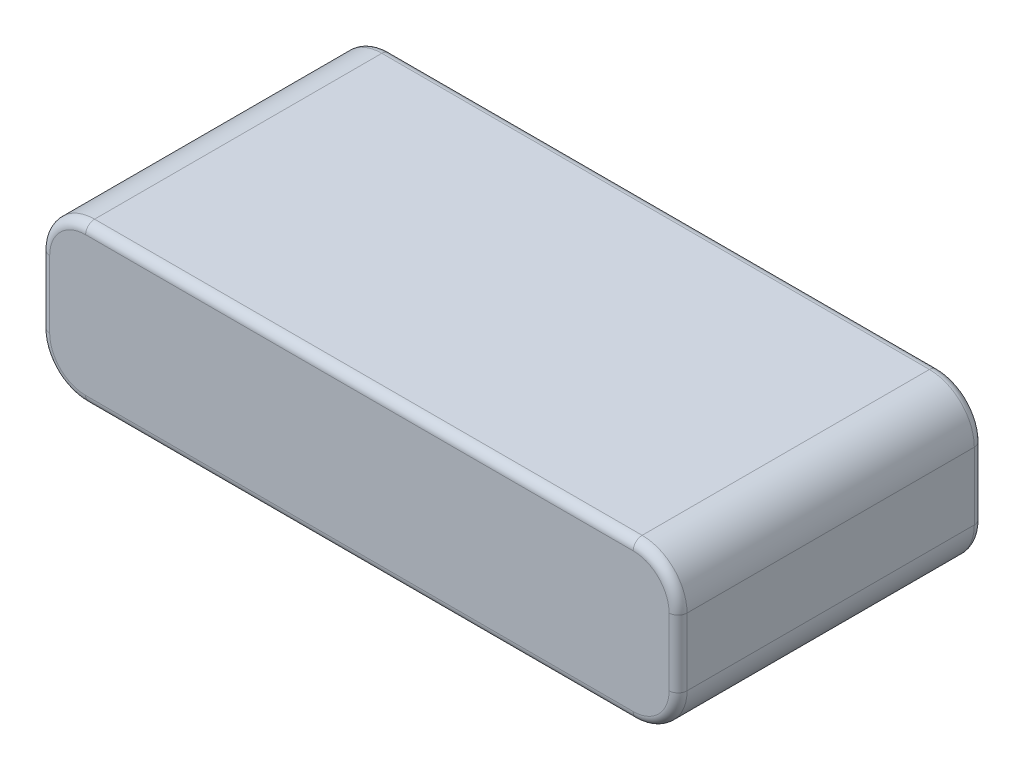
ISO-10303-21;
HEADER;
FILE_DESCRIPTION(('STEP AP214'),'2;1');
FILE_NAME('part.step','',(''),(''),'','','');
FILE_SCHEMA(('AUTOMOTIVE_DESIGN { 1 0 10303 214 1 1 1 1 }'));
ENDSEC;
DATA;
#1=APPLICATION_CONTEXT('core data for automotive mechanical design processes');
#2=APPLICATION_PROTOCOL_DEFINITION('international standard','automotive_design',2000,#1);
#3=PRODUCT_CONTEXT('',#1,'mechanical');
#4=PRODUCT('Part','Part','',(#3));
#5=PRODUCT_RELATED_PRODUCT_CATEGORY('part','',(#4));
#6=PRODUCT_DEFINITION_FORMATION('','',#4);
#7=PRODUCT_DEFINITION_CONTEXT('part definition',#1,'design');
#8=PRODUCT_DEFINITION('design','',#6,#7);
#9=PRODUCT_DEFINITION_SHAPE('','',#8);
#10=(LENGTH_UNIT() NAMED_UNIT(*) SI_UNIT(.MILLI.,.METRE.));
#11=(NAMED_UNIT(*) PLANE_ANGLE_UNIT() SI_UNIT($,.RADIAN.));
#12=(NAMED_UNIT(*) SI_UNIT($,.STERADIAN.) SOLID_ANGLE_UNIT());
#13=UNCERTAINTY_MEASURE_WITH_UNIT(LENGTH_MEASURE(1.E-05),#10,'distance_accuracy_value','');
#14=(GEOMETRIC_REPRESENTATION_CONTEXT(3) GLOBAL_UNCERTAINTY_ASSIGNED_CONTEXT((#13)) GLOBAL_UNIT_ASSIGNED_CONTEXT((#10,
#11,#12)) REPRESENTATION_CONTEXT('',''));
#15=CARTESIAN_POINT('',(0.,0.,0.));
#16=DIRECTION('',(0.,0.,1.));
#17=DIRECTION('',(1.,0.,0.));
#18=AXIS2_PLACEMENT_3D('',#15,#16,#17);
#19=CARTESIAN_POINT('',(-35.5,17.5,17.));
#20=DIRECTION('',(1.,0.,0.));
#21=DIRECTION('',(0.,0.,-1.));
#22=AXIS2_PLACEMENT_3D('',#19,#20,#21);
#23=PLANE('',#22);
#24=DIRECTION('',(0.,0.,1.));
#25=VECTOR('',#24,1.);
#26=CARTESIAN_POINT('',(-35.5,5.,17.));
#27=LINE('',#26,#25);
#28=CARTESIAN_POINT('',(-35.5,5.,-16.));
#29=VERTEX_POINT('',#28);
#30=CARTESIAN_POINT('',(-35.5,5.,16.));
#31=VERTEX_POINT('',#30);
#32=EDGE_CURVE('E287',#29,#31,#27,.T.);
#33=ORIENTED_EDGE('',*,*,#32,.T.);
#34=DIRECTION('',(0.,-1.,0.));
#35=VECTOR('',#34,1.);
#36=CARTESIAN_POINT('',(-35.5,17.5,16.));
#37=LINE('',#36,#35);
#38=CARTESIAN_POINT('',(-35.5,12.5,16.));
#39=VERTEX_POINT('',#38);
#40=EDGE_CURVE('E203',#31,#39,#37,.F.);
#41=ORIENTED_EDGE('',*,*,#40,.T.);
#42=DIRECTION('',(0.,0.,1.));
#43=VECTOR('',#42,1.);
#44=CARTESIAN_POINT('',(-35.5,12.5,-17.));
#45=LINE('',#44,#43);
#46=CARTESIAN_POINT('',(-35.5,12.5,-16.));
#47=VERTEX_POINT('',#46);
#48=EDGE_CURVE('E292',#39,#47,#45,.F.);
#49=ORIENTED_EDGE('',*,*,#48,.T.);
#50=DIRECTION('',(0.,-1.,0.));
#51=VECTOR('',#50,1.);
#52=CARTESIAN_POINT('',(-35.5,17.5,-16.));
#53=LINE('',#52,#51);
#54=EDGE_CURVE('E201',#47,#29,#53,.T.);
#55=ORIENTED_EDGE('',*,*,#54,.T.);
#56=EDGE_LOOP('',(#33,#41,#49,#55));
#57=FACE_BOUND('',#56,.T.);
#58=ADVANCED_FACE('F37',(#57),#23,.F.);
#59=CARTESIAN_POINT('',(35.5,17.5,17.));
#60=DIRECTION('',(0.,0.,-1.));
#61=DIRECTION('',(-1.,0.,0.));
#62=AXIS2_PLACEMENT_3D('',#59,#60,#61);
#63=PLANE('',#62);
#64=DIRECTION('',(0.,-1.,0.));
#65=VECTOR('',#64,1.);
#66=CARTESIAN_POINT('',(34.5,17.5,17.));
#67=LINE('',#66,#65);
#68=CARTESIAN_POINT('',(34.5,5.,17.));
#69=VERTEX_POINT('',#68);
#70=CARTESIAN_POINT('',(34.5,12.5,17.));
#71=VERTEX_POINT('',#70);
#72=EDGE_CURVE('E174',#69,#71,#67,.F.);
#73=ORIENTED_EDGE('',*,*,#72,.T.);
#74=CARTESIAN_POINT('',(30.5,12.5,17.));
#75=DIRECTION('',(0.,0.,-1.));
#76=DIRECTION('',(-1.,0.,0.));
#77=AXIS2_PLACEMENT_3D('',#74,#75,#76);
#78=CIRCLE('',#77,4.);
#79=CARTESIAN_POINT('',(30.5,16.5,17.));
#80=VERTEX_POINT('',#79);
#81=EDGE_CURVE('E155',#71,#80,#78,.F.);
#82=ORIENTED_EDGE('',*,*,#81,.T.);
#83=DIRECTION('',(1.,0.,0.));
#84=VECTOR('',#83,1.);
#85=CARTESIAN_POINT('',(-30.5,16.5,17.));
#86=LINE('',#85,#84);
#87=CARTESIAN_POINT('',(-30.5,16.5,17.));
#88=VERTEX_POINT('',#87);
#89=EDGE_CURVE('E163',#80,#88,#86,.F.);
#90=ORIENTED_EDGE('',*,*,#89,.T.);
#91=CARTESIAN_POINT('',(-30.5,12.5,17.));
#92=DIRECTION('',(0.,0.,-1.));
#93=DIRECTION('',(-1.,0.,0.));
#94=AXIS2_PLACEMENT_3D('',#91,#92,#93);
#95=CIRCLE('',#94,4.);
#96=CARTESIAN_POINT('',(-34.5,12.5,17.));
#97=VERTEX_POINT('',#96);
#98=EDGE_CURVE('E169',#88,#97,#95,.F.);
#99=ORIENTED_EDGE('',*,*,#98,.T.);
#100=DIRECTION('',(0.,-1.,0.));
#101=VECTOR('',#100,1.);
#102=CARTESIAN_POINT('',(-34.5,17.5,17.));
#103=LINE('',#102,#101);
#104=CARTESIAN_POINT('',(-34.5,5.,17.));
#105=VERTEX_POINT('',#104);
#106=EDGE_CURVE('E305',#97,#105,#103,.T.);
#107=ORIENTED_EDGE('',*,*,#106,.T.);
#108=CARTESIAN_POINT('',(-30.5,5.,17.));
#109=DIRECTION('',(0.,0.,-1.));
#110=DIRECTION('',(-1.,0.,0.));
#111=AXIS2_PLACEMENT_3D('',#108,#109,#110);
#112=CIRCLE('',#111,4.);
#113=CARTESIAN_POINT('',(-30.5,1.,17.));
#114=VERTEX_POINT('',#113);
#115=EDGE_CURVE('E307',#105,#114,#112,.F.);
#116=ORIENTED_EDGE('',*,*,#115,.T.);
#117=DIRECTION('',(1.,0.,0.));
#118=VECTOR('',#117,1.);
#119=CARTESIAN_POINT('',(35.5,1.,17.));
#120=LINE('',#119,#118);
#121=CARTESIAN_POINT('',(30.5,1.,17.));
#122=VERTEX_POINT('',#121);
#123=EDGE_CURVE('E309',#114,#122,#120,.T.);
#124=ORIENTED_EDGE('',*,*,#123,.T.);
#125=CARTESIAN_POINT('',(30.5,5.,17.));
#126=DIRECTION('',(0.,0.,-1.));
#127=DIRECTION('',(-1.,0.,0.));
#128=AXIS2_PLACEMENT_3D('',#125,#126,#127);
#129=CIRCLE('',#128,4.);
#130=EDGE_CURVE('E179',#122,#69,#129,.F.);
#131=ORIENTED_EDGE('',*,*,#130,.T.);
#132=EDGE_LOOP('',(#73,#82,#90,#99,#107,#116,#124,#131));
#133=FACE_BOUND('',#132,.T.);
#134=ADVANCED_FACE('F172',(#133),#63,.F.);
#135=CARTESIAN_POINT('',(35.5,17.5,17.));
#136=DIRECTION('',(-1.,0.,0.));
#137=DIRECTION('',(0.,0.,1.));
#138=AXIS2_PLACEMENT_3D('',#135,#136,#137);
#139=PLANE('',#138);
#140=DIRECTION('',(0.,0.,-1.));
#141=VECTOR('',#140,1.);
#142=CARTESIAN_POINT('',(35.5,12.5,17.));
#143=LINE('',#142,#141);
#144=CARTESIAN_POINT('',(35.5,12.5,-16.));
#145=VERTEX_POINT('',#144);
#146=CARTESIAN_POINT('',(35.5,12.5,16.));
#147=VERTEX_POINT('',#146);
#148=EDGE_CURVE('E280',#145,#147,#143,.F.);
#149=ORIENTED_EDGE('',*,*,#148,.T.);
#150=DIRECTION('',(0.,-1.,0.));
#151=VECTOR('',#150,1.);
#152=CARTESIAN_POINT('',(35.5,17.5,16.));
#153=LINE('',#152,#151);
#154=CARTESIAN_POINT('',(35.5,5.,16.));
#155=VERTEX_POINT('',#154);
#156=EDGE_CURVE('E186',#147,#155,#153,.T.);
#157=ORIENTED_EDGE('',*,*,#156,.T.);
#158=DIRECTION('',(0.,0.,-1.));
#159=VECTOR('',#158,1.);
#160=CARTESIAN_POINT('',(35.5,5.,17.));
#161=LINE('',#160,#159);
#162=CARTESIAN_POINT('',(35.5,5.,-16.));
#163=VERTEX_POINT('',#162);
#164=EDGE_CURVE('E170',#155,#163,#161,.T.);
#165=ORIENTED_EDGE('',*,*,#164,.T.);
#166=DIRECTION('',(0.,-1.,0.));
#167=VECTOR('',#166,1.);
#168=CARTESIAN_POINT('',(35.5,17.5,-16.));
#169=LINE('',#168,#167);
#170=EDGE_CURVE('E184',#163,#145,#169,.F.);
#171=ORIENTED_EDGE('',*,*,#170,.T.);
#172=EDGE_LOOP('',(#149,#157,#165,#171));
#173=FACE_BOUND('',#172,.T.);
#174=ADVANCED_FACE('F322',(#173),#139,.F.);
#175=CARTESIAN_POINT('',(35.5,17.5,-17.));
#176=DIRECTION('',(0.,0.,1.));
#177=DIRECTION('',(1.,0.,0.));
#178=AXIS2_PLACEMENT_3D('',#175,#176,#177);
#179=PLANE('',#178);
#180=DIRECTION('',(-1.,0.,0.));
#181=VECTOR('',#180,1.);
#182=CARTESIAN_POINT('',(35.5,1.,-17.));
#183=LINE('',#182,#181);
#184=CARTESIAN_POINT('',(30.5,1.,-17.));
#185=VERTEX_POINT('',#184);
#186=CARTESIAN_POINT('',(-30.5,1.,-17.));
#187=VERTEX_POINT('',#186);
#188=EDGE_CURVE('E46',#185,#187,#183,.T.);
#189=ORIENTED_EDGE('',*,*,#188,.T.);
#190=CARTESIAN_POINT('',(-30.5,5.,-17.));
#191=DIRECTION('',(0.,0.,1.));
#192=DIRECTION('',(1.,0.,0.));
#193=AXIS2_PLACEMENT_3D('',#190,#191,#192);
#194=CIRCLE('',#193,4.);
#195=CARTESIAN_POINT('',(-34.5,5.,-17.));
#196=VERTEX_POINT('',#195);
#197=EDGE_CURVE('E11',#187,#196,#194,.F.);
#198=ORIENTED_EDGE('',*,*,#197,.T.);
#199=DIRECTION('',(0.,-1.,0.));
#200=VECTOR('',#199,1.);
#201=CARTESIAN_POINT('',(-34.5,17.5,-17.));
#202=LINE('',#201,#200);
#203=CARTESIAN_POINT('',(-34.5,12.5,-17.));
#204=VERTEX_POINT('',#203);
#205=EDGE_CURVE('E213',#196,#204,#202,.F.);
#206=ORIENTED_EDGE('',*,*,#205,.T.);
#207=CARTESIAN_POINT('',(-30.5,12.5,-17.));
#208=DIRECTION('',(0.,0.,1.));
#209=DIRECTION('',(1.,0.,0.));
#210=AXIS2_PLACEMENT_3D('',#207,#208,#209);
#211=CIRCLE('',#210,4.);
#212=CARTESIAN_POINT('',(-30.5,16.5,-17.));
#213=VERTEX_POINT('',#212);
#214=EDGE_CURVE('E215',#204,#213,#211,.F.);
#215=ORIENTED_EDGE('',*,*,#214,.T.);
#216=DIRECTION('',(-1.,0.,0.));
#217=VECTOR('',#216,1.);
#218=CARTESIAN_POINT('',(30.5,16.5,-17.));
#219=LINE('',#218,#217);
#220=CARTESIAN_POINT('',(30.5,16.5,-17.));
#221=VERTEX_POINT('',#220);
#222=EDGE_CURVE('E217',#213,#221,#219,.F.);
#223=ORIENTED_EDGE('',*,*,#222,.T.);
#224=CARTESIAN_POINT('',(30.5,12.5,-17.));
#225=DIRECTION('',(0.,0.,1.));
#226=DIRECTION('',(1.,0.,0.));
#227=AXIS2_PLACEMENT_3D('',#224,#225,#226);
#228=CIRCLE('',#227,4.);
#229=CARTESIAN_POINT('',(34.5,12.5,-17.));
#230=VERTEX_POINT('',#229);
#231=EDGE_CURVE('E219',#221,#230,#228,.F.);
#232=ORIENTED_EDGE('',*,*,#231,.T.);
#233=DIRECTION('',(0.,-1.,0.));
#234=VECTOR('',#233,1.);
#235=CARTESIAN_POINT('',(34.5,17.5,-17.));
#236=LINE('',#235,#234);
#237=CARTESIAN_POINT('',(34.5,5.,-17.));
#238=VERTEX_POINT('',#237);
#239=EDGE_CURVE('E221',#230,#238,#236,.T.);
#240=ORIENTED_EDGE('',*,*,#239,.T.);
#241=CARTESIAN_POINT('',(30.5,5.,-17.));
#242=DIRECTION('',(0.,0.,1.));
#243=DIRECTION('',(1.,0.,0.));
#244=AXIS2_PLACEMENT_3D('',#241,#242,#243);
#245=CIRCLE('',#244,4.);
#246=EDGE_CURVE('E57',#238,#185,#245,.F.);
#247=ORIENTED_EDGE('',*,*,#246,.T.);
#248=EDGE_LOOP('',(#189,#198,#206,#215,#223,#232,#240,#247));
#249=FACE_BOUND('',#248,.T.);
#250=ADVANCED_FACE('F338',(#249),#179,.F.);
#251=CARTESIAN_POINT('',(0.,17.5,0.));
#252=DIRECTION('',(0.,1.,0.));
#253=DIRECTION('',(0.,0.,1.));
#254=AXIS2_PLACEMENT_3D('',#251,#252,#253);
#255=PLANE('',#254);
#256=DIRECTION('',(0.,0.,1.));
#257=VECTOR('',#256,1.);
#258=CARTESIAN_POINT('',(-30.5,17.5,17.));
#259=LINE('',#258,#257);
#260=CARTESIAN_POINT('',(-30.5,17.5,-16.));
#261=VERTEX_POINT('',#260);
#262=CARTESIAN_POINT('',(-30.5,17.5,16.));
#263=VERTEX_POINT('',#262);
#264=EDGE_CURVE('E285',#261,#263,#259,.T.);
#265=ORIENTED_EDGE('',*,*,#264,.T.);
#266=DIRECTION('',(1.,0.,0.));
#267=VECTOR('',#266,1.);
#268=CARTESIAN_POINT('',(30.5,17.5,16.));
#269=LINE('',#268,#267);
#270=CARTESIAN_POINT('',(30.5,17.5,16.));
#271=VERTEX_POINT('',#270);
#272=EDGE_CURVE('E211',#263,#271,#269,.T.);
#273=ORIENTED_EDGE('',*,*,#272,.T.);
#274=DIRECTION('',(0.,0.,-1.));
#275=VECTOR('',#274,1.);
#276=CARTESIAN_POINT('',(30.5,17.5,-17.));
#277=LINE('',#276,#275);
#278=CARTESIAN_POINT('',(30.5,17.5,-16.));
#279=VERTEX_POINT('',#278);
#280=EDGE_CURVE('E242',#271,#279,#277,.T.);
#281=ORIENTED_EDGE('',*,*,#280,.T.);
#282=DIRECTION('',(-1.,0.,0.));
#283=VECTOR('',#282,1.);
#284=CARTESIAN_POINT('',(-30.5,17.5,-16.));
#285=LINE('',#284,#283);
#286=EDGE_CURVE('E209',#279,#261,#285,.T.);
#287=ORIENTED_EDGE('',*,*,#286,.T.);
#288=EDGE_LOOP('',(#265,#273,#281,#287));
#289=FACE_BOUND('',#288,.T.);
#290=ADVANCED_FACE('F283',(#289),#255,.T.);
#291=CARTESIAN_POINT('',(0.,0.,0.));
#292=DIRECTION('',(0.,1.,0.));
#293=DIRECTION('',(0.,0.,1.));
#294=AXIS2_PLACEMENT_3D('',#291,#292,#293);
#295=PLANE('',#294);
#296=DIRECTION('',(0.,0.,-1.));
#297=VECTOR('',#296,1.);
#298=CARTESIAN_POINT('',(30.5,0.,0.));
#299=LINE('',#298,#297);
#300=CARTESIAN_POINT('',(30.5,0.,-16.));
#301=VERTEX_POINT('',#300);
#302=CARTESIAN_POINT('',(30.5,0.,16.));
#303=VERTEX_POINT('',#302);
#304=EDGE_CURVE('E295',#301,#303,#299,.F.);
#305=ORIENTED_EDGE('',*,*,#304,.T.);
#306=DIRECTION('',(1.,0.,0.));
#307=VECTOR('',#306,1.);
#308=CARTESIAN_POINT('',(0.,0.,16.));
#309=LINE('',#308,#307);
#310=CARTESIAN_POINT('',(-30.5,0.,16.));
#311=VERTEX_POINT('',#310);
#312=EDGE_CURVE('E194',#303,#311,#309,.F.);
#313=ORIENTED_EDGE('',*,*,#312,.T.);
#314=DIRECTION('',(0.,0.,1.));
#315=VECTOR('',#314,1.);
#316=CARTESIAN_POINT('',(-30.5,0.,0.));
#317=LINE('',#316,#315);
#318=CARTESIAN_POINT('',(-30.5,0.,-16.));
#319=VERTEX_POINT('',#318);
#320=EDGE_CURVE('E298',#311,#319,#317,.F.);
#321=ORIENTED_EDGE('',*,*,#320,.T.);
#322=DIRECTION('',(-1.,0.,0.));
#323=VECTOR('',#322,1.);
#324=CARTESIAN_POINT('',(0.,0.,-16.));
#325=LINE('',#324,#323);
#326=EDGE_CURVE('E192',#319,#301,#325,.F.);
#327=ORIENTED_EDGE('',*,*,#326,.T.);
#328=EDGE_LOOP('',(#305,#313,#321,#327));
#329=FACE_BOUND('',#328,.T.);
#330=ADVANCED_FACE('F365',(#329),#295,.F.);
#331=CARTESIAN_POINT('',(-30.5,12.5,0.));
#332=DIRECTION('',(0.,0.,-1.));
#333=DIRECTION('',(-1.,0.,0.));
#334=AXIS2_PLACEMENT_3D('',#331,#332,#333);
#335=CYLINDRICAL_SURFACE('',#334,5.);
#336=ORIENTED_EDGE('',*,*,#48,.F.);
#337=CARTESIAN_POINT('',(-30.5,12.5,16.));
#338=DIRECTION('',(0.,0.,-1.));
#339=DIRECTION('',(-1.,0.,0.));
#340=AXIS2_PLACEMENT_3D('',#337,#338,#339);
#341=CIRCLE('',#340,5.);
#342=EDGE_CURVE('E207',#39,#263,#341,.T.);
#343=ORIENTED_EDGE('',*,*,#342,.T.);
#344=ORIENTED_EDGE('',*,*,#264,.F.);
#345=CARTESIAN_POINT('',(-30.5,12.5,-16.));
#346=DIRECTION('',(0.,0.,1.));
#347=DIRECTION('',(1.,0.,0.));
#348=AXIS2_PLACEMENT_3D('',#345,#346,#347);
#349=CIRCLE('',#348,5.);
#350=EDGE_CURVE('E205',#261,#47,#349,.T.);
#351=ORIENTED_EDGE('',*,*,#350,.T.);
#352=EDGE_LOOP('',(#336,#343,#344,#351));
#353=FACE_BOUND('',#352,.T.);
#354=ADVANCED_FACE('F367',(#353),#335,.T.);
#355=CARTESIAN_POINT('',(-30.5,5.,17.));
#356=DIRECTION('',(0.,0.,1.));
#357=DIRECTION('',(1.,0.,0.));
#358=AXIS2_PLACEMENT_3D('',#355,#356,#357);
#359=CYLINDRICAL_SURFACE('',#358,5.);
#360=ORIENTED_EDGE('',*,*,#320,.F.);
#361=CARTESIAN_POINT('',(-30.5,5.,16.));
#362=DIRECTION('',(0.,0.,-1.));
#363=DIRECTION('',(-1.,0.,0.));
#364=AXIS2_PLACEMENT_3D('',#361,#362,#363);
#365=CIRCLE('',#364,5.);
#366=EDGE_CURVE('E199',#311,#31,#365,.T.);
#367=ORIENTED_EDGE('',*,*,#366,.T.);
#368=ORIENTED_EDGE('',*,*,#32,.F.);
#369=CARTESIAN_POINT('',(-30.5,5.,-16.));
#370=DIRECTION('',(0.,0.,1.));
#371=DIRECTION('',(1.,0.,0.));
#372=AXIS2_PLACEMENT_3D('',#369,#370,#371);
#373=CIRCLE('',#372,5.);
#374=EDGE_CURVE('E196',#29,#319,#373,.T.);
#375=ORIENTED_EDGE('',*,*,#374,.T.);
#376=EDGE_LOOP('',(#360,#367,#368,#375));
#377=FACE_BOUND('',#376,.T.);
#378=ADVANCED_FACE('F354',(#377),#359,.T.);
#379=CARTESIAN_POINT('',(30.5,5.,17.));
#380=DIRECTION('',(0.,0.,-1.));
#381=DIRECTION('',(-1.,0.,0.));
#382=AXIS2_PLACEMENT_3D('',#379,#380,#381);
#383=CYLINDRICAL_SURFACE('',#382,5.);
#384=ORIENTED_EDGE('',*,*,#164,.F.);
#385=CARTESIAN_POINT('',(30.5,5.,16.));
#386=DIRECTION('',(0.,0.,-1.));
#387=DIRECTION('',(-1.,0.,0.));
#388=AXIS2_PLACEMENT_3D('',#385,#386,#387);
#389=CIRCLE('',#388,5.);
#390=EDGE_CURVE('E190',#155,#303,#389,.T.);
#391=ORIENTED_EDGE('',*,*,#390,.T.);
#392=ORIENTED_EDGE('',*,*,#304,.F.);
#393=CARTESIAN_POINT('',(30.5,5.,-16.));
#394=DIRECTION('',(0.,0.,1.));
#395=DIRECTION('',(1.,0.,0.));
#396=AXIS2_PLACEMENT_3D('',#393,#394,#395);
#397=CIRCLE('',#396,5.);
#398=EDGE_CURVE('E188',#301,#163,#397,.T.);
#399=ORIENTED_EDGE('',*,*,#398,.T.);
#400=EDGE_LOOP('',(#384,#391,#392,#399));
#401=FACE_BOUND('',#400,.T.);
#402=ADVANCED_FACE('F324',(#401),#383,.T.);
#403=CARTESIAN_POINT('',(30.5,12.5,0.));
#404=DIRECTION('',(0.,0.,1.));
#405=DIRECTION('',(1.,0.,0.));
#406=AXIS2_PLACEMENT_3D('',#403,#404,#405);
#407=CYLINDRICAL_SURFACE('',#406,5.);
#408=ORIENTED_EDGE('',*,*,#280,.F.);
#409=CARTESIAN_POINT('',(30.5,12.5,16.));
#410=DIRECTION('',(0.,0.,-1.));
#411=DIRECTION('',(-1.,0.,0.));
#412=AXIS2_PLACEMENT_3D('',#409,#410,#411);
#413=CIRCLE('',#412,5.);
#414=EDGE_CURVE('E157',#271,#147,#413,.T.);
#415=ORIENTED_EDGE('',*,*,#414,.T.);
#416=ORIENTED_EDGE('',*,*,#148,.F.);
#417=CARTESIAN_POINT('',(30.5,12.5,-16.));
#418=DIRECTION('',(0.,0.,1.));
#419=DIRECTION('',(1.,0.,0.));
#420=AXIS2_PLACEMENT_3D('',#417,#418,#419);
#421=CIRCLE('',#420,5.);
#422=EDGE_CURVE('E176',#145,#279,#421,.T.);
#423=ORIENTED_EDGE('',*,*,#422,.T.);
#424=EDGE_LOOP('',(#408,#415,#416,#423));
#425=FACE_BOUND('',#424,.T.);
#426=ADVANCED_FACE('F278',(#425),#407,.T.);
#427=CARTESIAN_POINT('',(-30.5,5.,16.));
#428=DIRECTION('',(0.,0.,-1.));
#429=DIRECTION('',(-1.,0.,0.));
#430=AXIS2_PLACEMENT_3D('',#427,#428,#429);
#431=TOROIDAL_SURFACE('',#430,4.,1.);
#432=CARTESIAN_POINT('',(-34.5,5.,16.));
#433=DIRECTION('',(0.,1.,0.));
#434=DIRECTION('',(0.,0.,1.));
#435=AXIS2_PLACEMENT_3D('',#432,#433,#434);
#436=CIRCLE('',#435,1.);
#437=EDGE_CURVE('E236',#31,#105,#436,.T.);
#438=ORIENTED_EDGE('',*,*,#437,.F.);
#439=ORIENTED_EDGE('',*,*,#366,.F.);
#440=CARTESIAN_POINT('',(-30.5,1.,16.));
#441=DIRECTION('',(1.,0.,0.));
#442=DIRECTION('',(0.,0.,-1.));
#443=AXIS2_PLACEMENT_3D('',#440,#441,#442);
#444=CIRCLE('',#443,1.);
#445=EDGE_CURVE('E239',#114,#311,#444,.T.);
#446=ORIENTED_EDGE('',*,*,#445,.F.);
#447=ORIENTED_EDGE('',*,*,#115,.F.);
#448=EDGE_LOOP('',(#438,#439,#446,#447));
#449=FACE_BOUND('',#448,.T.);
#450=ADVANCED_FACE('F358',(#449),#431,.T.);
#451=CARTESIAN_POINT('',(35.5,1.,16.));
#452=DIRECTION('',(1.,0.,0.));
#453=DIRECTION('',(0.,0.,-1.));
#454=AXIS2_PLACEMENT_3D('',#451,#452,#453);
#455=CYLINDRICAL_SURFACE('',#454,1.);
#456=ORIENTED_EDGE('',*,*,#445,.T.);
#457=ORIENTED_EDGE('',*,*,#312,.F.);
#458=CARTESIAN_POINT('',(30.5,1.,16.));
#459=DIRECTION('',(1.,0.,0.));
#460=DIRECTION('',(0.,0.,-1.));
#461=AXIS2_PLACEMENT_3D('',#458,#459,#460);
#462=CIRCLE('',#461,1.);
#463=EDGE_CURVE('E233',#122,#303,#462,.T.);
#464=ORIENTED_EDGE('',*,*,#463,.F.);
#465=ORIENTED_EDGE('',*,*,#123,.F.);
#466=EDGE_LOOP('',(#456,#457,#464,#465));
#467=FACE_BOUND('',#466,.T.);
#468=ADVANCED_FACE('F363',(#467),#455,.T.);
#469=CARTESIAN_POINT('',(-34.5,17.5,16.));
#470=DIRECTION('',(0.,-1.,0.));
#471=DIRECTION('',(0.,0.,-1.));
#472=AXIS2_PLACEMENT_3D('',#469,#470,#471);
#473=CYLINDRICAL_SURFACE('',#472,1.);
#474=ORIENTED_EDGE('',*,*,#437,.T.);
#475=ORIENTED_EDGE('',*,*,#106,.F.);
#476=CARTESIAN_POINT('',(-34.5,12.5,16.));
#477=DIRECTION('',(0.,1.,0.));
#478=DIRECTION('',(0.,0.,1.));
#479=AXIS2_PLACEMENT_3D('',#476,#477,#478);
#480=CIRCLE('',#479,1.);
#481=EDGE_CURVE('E230',#39,#97,#480,.T.);
#482=ORIENTED_EDGE('',*,*,#481,.F.);
#483=ORIENTED_EDGE('',*,*,#40,.F.);
#484=EDGE_LOOP('',(#474,#475,#482,#483));
#485=FACE_BOUND('',#484,.T.);
#486=ADVANCED_FACE('F403',(#485),#473,.T.);
#487=CARTESIAN_POINT('',(30.5,5.,16.));
#488=DIRECTION('',(0.,0.,-1.));
#489=DIRECTION('',(-1.,0.,0.));
#490=AXIS2_PLACEMENT_3D('',#487,#488,#489);
#491=TOROIDAL_SURFACE('',#490,4.,1.);
#492=ORIENTED_EDGE('',*,*,#463,.T.);
#493=ORIENTED_EDGE('',*,*,#390,.F.);
#494=CARTESIAN_POINT('',(34.5,5.,16.));
#495=DIRECTION('',(0.,1.,0.));
#496=DIRECTION('',(0.,0.,1.));
#497=AXIS2_PLACEMENT_3D('',#494,#495,#496);
#498=CIRCLE('',#497,1.);
#499=EDGE_CURVE('E227',#69,#155,#498,.T.);
#500=ORIENTED_EDGE('',*,*,#499,.F.);
#501=ORIENTED_EDGE('',*,*,#130,.F.);
#502=EDGE_LOOP('',(#492,#493,#500,#501));
#503=FACE_BOUND('',#502,.T.);
#504=ADVANCED_FACE('F316',(#503),#491,.T.);
#505=CARTESIAN_POINT('',(-30.5,12.5,16.));
#506=DIRECTION('',(0.,0.,-1.));
#507=DIRECTION('',(-1.,0.,0.));
#508=AXIS2_PLACEMENT_3D('',#505,#506,#507);
#509=TOROIDAL_SURFACE('',#508,4.,1.);
#510=ORIENTED_EDGE('',*,*,#481,.T.);
#511=ORIENTED_EDGE('',*,*,#98,.F.);
#512=CARTESIAN_POINT('',(-30.5,16.5,16.));
#513=DIRECTION('',(1.,0.,0.));
#514=DIRECTION('',(0.,0.,-1.));
#515=AXIS2_PLACEMENT_3D('',#512,#513,#514);
#516=CIRCLE('',#515,1.);
#517=EDGE_CURVE('E166',#263,#88,#516,.T.);
#518=ORIENTED_EDGE('',*,*,#517,.F.);
#519=ORIENTED_EDGE('',*,*,#342,.F.);
#520=EDGE_LOOP('',(#510,#511,#518,#519));
#521=FACE_BOUND('',#520,.T.);
#522=ADVANCED_FACE('F397',(#521),#509,.T.);
#523=CARTESIAN_POINT('',(34.5,17.5,16.));
#524=DIRECTION('',(0.,-1.,0.));
#525=DIRECTION('',(0.,0.,-1.));
#526=AXIS2_PLACEMENT_3D('',#523,#524,#525);
#527=CYLINDRICAL_SURFACE('',#526,1.);
#528=ORIENTED_EDGE('',*,*,#499,.T.);
#529=ORIENTED_EDGE('',*,*,#156,.F.);
#530=CARTESIAN_POINT('',(34.5,12.5,16.));
#531=DIRECTION('',(0.,1.,0.));
#532=DIRECTION('',(0.,0.,1.));
#533=AXIS2_PLACEMENT_3D('',#530,#531,#532);
#534=CIRCLE('',#533,1.);
#535=EDGE_CURVE('E160',#71,#147,#534,.T.);
#536=ORIENTED_EDGE('',*,*,#535,.F.);
#537=ORIENTED_EDGE('',*,*,#72,.F.);
#538=EDGE_LOOP('',(#528,#529,#536,#537));
#539=FACE_BOUND('',#538,.T.);
#540=ADVANCED_FACE('F319',(#539),#527,.T.);
#541=CARTESIAN_POINT('',(0.,16.5,16.));
#542=DIRECTION('',(-1.,0.,0.));
#543=DIRECTION('',(0.,0.,1.));
#544=AXIS2_PLACEMENT_3D('',#541,#542,#543);
#545=CYLINDRICAL_SURFACE('',#544,1.);
#546=ORIENTED_EDGE('',*,*,#517,.T.);
#547=ORIENTED_EDGE('',*,*,#89,.F.);
#548=CARTESIAN_POINT('',(30.5,16.5,16.));
#549=DIRECTION('',(1.,0.,0.));
#550=DIRECTION('',(0.,0.,-1.));
#551=AXIS2_PLACEMENT_3D('',#548,#549,#550);
#552=CIRCLE('',#551,1.);
#553=EDGE_CURVE('E151',#271,#80,#552,.T.);
#554=ORIENTED_EDGE('',*,*,#553,.F.);
#555=ORIENTED_EDGE('',*,*,#272,.F.);
#556=EDGE_LOOP('',(#546,#547,#554,#555));
#557=FACE_BOUND('',#556,.T.);
#558=ADVANCED_FACE('F164',(#557),#545,.T.);
#559=CARTESIAN_POINT('',(30.5,12.5,16.));
#560=DIRECTION('',(0.,0.,-1.));
#561=DIRECTION('',(-1.,0.,0.));
#562=AXIS2_PLACEMENT_3D('',#559,#560,#561);
#563=TOROIDAL_SURFACE('',#562,4.,1.);
#564=ORIENTED_EDGE('',*,*,#535,.T.);
#565=ORIENTED_EDGE('',*,*,#414,.F.);
#566=ORIENTED_EDGE('',*,*,#553,.T.);
#567=ORIENTED_EDGE('',*,*,#81,.F.);
#568=EDGE_LOOP('',(#564,#565,#566,#567));
#569=FACE_BOUND('',#568,.T.);
#570=ADVANCED_FACE('F153',(#569),#563,.T.);
#571=CARTESIAN_POINT('',(30.5,12.5,-16.));
#572=DIRECTION('',(0.,0.,1.));
#573=DIRECTION('',(1.,0.,0.));
#574=AXIS2_PLACEMENT_3D('',#571,#572,#573);
#575=TOROIDAL_SURFACE('',#574,4.,1.);
#576=CARTESIAN_POINT('',(30.5,16.5,-16.));
#577=DIRECTION('',(-1.,0.,0.));
#578=DIRECTION('',(0.,0.,1.));
#579=AXIS2_PLACEMENT_3D('',#576,#577,#578);
#580=CIRCLE('',#579,1.);
#581=EDGE_CURVE('E258',#279,#221,#580,.T.);
#582=ORIENTED_EDGE('',*,*,#581,.F.);
#583=ORIENTED_EDGE('',*,*,#422,.F.);
#584=CARTESIAN_POINT('',(34.5,12.5,-16.));
#585=DIRECTION('',(0.,-1.,0.));
#586=DIRECTION('',(0.,0.,-1.));
#587=AXIS2_PLACEMENT_3D('',#584,#585,#586);
#588=CIRCLE('',#587,1.);
#589=EDGE_CURVE('E41',#230,#145,#588,.T.);
#590=ORIENTED_EDGE('',*,*,#589,.F.);
#591=ORIENTED_EDGE('',*,*,#231,.F.);
#592=EDGE_LOOP('',(#582,#583,#590,#591));
#593=FACE_BOUND('',#592,.T.);
#594=ADVANCED_FACE('F39',(#593),#575,.T.);
#595=CARTESIAN_POINT('',(34.5,17.5,-16.));
#596=DIRECTION('',(0.,-1.,0.));
#597=DIRECTION('',(0.,0.,-1.));
#598=AXIS2_PLACEMENT_3D('',#595,#596,#597);
#599=CYLINDRICAL_SURFACE('',#598,1.);
#600=ORIENTED_EDGE('',*,*,#589,.T.);
#601=ORIENTED_EDGE('',*,*,#170,.F.);
#602=CARTESIAN_POINT('',(34.5,5.,-16.));
#603=DIRECTION('',(0.,-1.,0.));
#604=DIRECTION('',(0.,0.,-1.));
#605=AXIS2_PLACEMENT_3D('',#602,#603,#604);
#606=CIRCLE('',#605,1.);
#607=EDGE_CURVE('E256',#238,#163,#606,.T.);
#608=ORIENTED_EDGE('',*,*,#607,.F.);
#609=ORIENTED_EDGE('',*,*,#239,.F.);
#610=EDGE_LOOP('',(#600,#601,#608,#609));
#611=FACE_BOUND('',#610,.T.);
#612=ADVANCED_FACE('F269',(#611),#599,.T.);
#613=CARTESIAN_POINT('',(0.,16.5,-16.));
#614=DIRECTION('',(1.,0.,0.));
#615=DIRECTION('',(0.,0.,-1.));
#616=AXIS2_PLACEMENT_3D('',#613,#614,#615);
#617=CYLINDRICAL_SURFACE('',#616,1.);
#618=ORIENTED_EDGE('',*,*,#581,.T.);
#619=ORIENTED_EDGE('',*,*,#222,.F.);
#620=CARTESIAN_POINT('',(-30.5,16.5,-16.));
#621=DIRECTION('',(-1.,0.,0.));
#622=DIRECTION('',(0.,0.,1.));
#623=AXIS2_PLACEMENT_3D('',#620,#621,#622);
#624=CIRCLE('',#623,1.);
#625=EDGE_CURVE('E253',#261,#213,#624,.T.);
#626=ORIENTED_EDGE('',*,*,#625,.F.);
#627=ORIENTED_EDGE('',*,*,#286,.F.);
#628=EDGE_LOOP('',(#618,#619,#626,#627));
#629=FACE_BOUND('',#628,.T.);
#630=ADVANCED_FACE('F421',(#629),#617,.T.);
#631=CARTESIAN_POINT('',(30.5,5.,-16.));
#632=DIRECTION('',(0.,0.,1.));
#633=DIRECTION('',(1.,0.,0.));
#634=AXIS2_PLACEMENT_3D('',#631,#632,#633);
#635=TOROIDAL_SURFACE('',#634,4.,1.);
#636=ORIENTED_EDGE('',*,*,#607,.T.);
#637=ORIENTED_EDGE('',*,*,#398,.F.);
#638=CARTESIAN_POINT('',(30.5,1.,-16.));
#639=DIRECTION('',(-1.,0.,0.));
#640=DIRECTION('',(0.,0.,1.));
#641=AXIS2_PLACEMENT_3D('',#638,#639,#640);
#642=CIRCLE('',#641,1.);
#643=EDGE_CURVE('E250',#185,#301,#642,.T.);
#644=ORIENTED_EDGE('',*,*,#643,.F.);
#645=ORIENTED_EDGE('',*,*,#246,.F.);
#646=EDGE_LOOP('',(#636,#637,#644,#645));
#647=FACE_BOUND('',#646,.T.);
#648=ADVANCED_FACE('F328',(#647),#635,.T.);
#649=CARTESIAN_POINT('',(-30.5,12.5,-16.));
#650=DIRECTION('',(0.,0.,1.));
#651=DIRECTION('',(1.,0.,0.));
#652=AXIS2_PLACEMENT_3D('',#649,#650,#651);
#653=TOROIDAL_SURFACE('',#652,4.,1.);
#654=ORIENTED_EDGE('',*,*,#625,.T.);
#655=ORIENTED_EDGE('',*,*,#214,.F.);
#656=CARTESIAN_POINT('',(-34.5,12.5,-16.));
#657=DIRECTION('',(0.,-1.,0.));
#658=DIRECTION('',(0.,0.,-1.));
#659=AXIS2_PLACEMENT_3D('',#656,#657,#658);
#660=CIRCLE('',#659,1.);
#661=EDGE_CURVE('E247',#47,#204,#660,.T.);
#662=ORIENTED_EDGE('',*,*,#661,.F.);
#663=ORIENTED_EDGE('',*,*,#350,.F.);
#664=EDGE_LOOP('',(#654,#655,#662,#663));
#665=FACE_BOUND('',#664,.T.);
#666=ADVANCED_FACE('F343',(#665),#653,.T.);
#667=CARTESIAN_POINT('',(35.5,1.,-16.));
#668=DIRECTION('',(-1.,0.,0.));
#669=DIRECTION('',(0.,0.,1.));
#670=AXIS2_PLACEMENT_3D('',#667,#668,#669);
#671=CYLINDRICAL_SURFACE('',#670,1.);
#672=ORIENTED_EDGE('',*,*,#643,.T.);
#673=ORIENTED_EDGE('',*,*,#326,.F.);
#674=CARTESIAN_POINT('',(-30.5,1.,-16.));
#675=DIRECTION('',(-1.,0.,0.));
#676=DIRECTION('',(0.,0.,1.));
#677=AXIS2_PLACEMENT_3D('',#674,#675,#676);
#678=CIRCLE('',#677,1.);
#679=EDGE_CURVE('E245',#187,#319,#678,.T.);
#680=ORIENTED_EDGE('',*,*,#679,.F.);
#681=ORIENTED_EDGE('',*,*,#188,.F.);
#682=EDGE_LOOP('',(#672,#673,#680,#681));
#683=FACE_BOUND('',#682,.T.);
#684=ADVANCED_FACE('F331',(#683),#671,.T.);
#685=CARTESIAN_POINT('',(-34.5,17.5,-16.));
#686=DIRECTION('',(0.,-1.,0.));
#687=DIRECTION('',(0.,0.,-1.));
#688=AXIS2_PLACEMENT_3D('',#685,#686,#687);
#689=CYLINDRICAL_SURFACE('',#688,1.);
#690=ORIENTED_EDGE('',*,*,#661,.T.);
#691=ORIENTED_EDGE('',*,*,#205,.F.);
#692=CARTESIAN_POINT('',(-34.5,5.,-16.));
#693=DIRECTION('',(0.,-1.,0.));
#694=DIRECTION('',(0.,0.,-1.));
#695=AXIS2_PLACEMENT_3D('',#692,#693,#694);
#696=CIRCLE('',#695,1.);
#697=EDGE_CURVE('E243',#29,#196,#696,.T.);
#698=ORIENTED_EDGE('',*,*,#697,.F.);
#699=ORIENTED_EDGE('',*,*,#54,.F.);
#700=EDGE_LOOP('',(#690,#691,#698,#699));
#701=FACE_BOUND('',#700,.T.);
#702=ADVANCED_FACE('F347',(#701),#689,.T.);
#703=CARTESIAN_POINT('',(-30.5,5.,-16.));
#704=DIRECTION('',(0.,0.,1.));
#705=DIRECTION('',(1.,0.,0.));
#706=AXIS2_PLACEMENT_3D('',#703,#704,#705);
#707=TOROIDAL_SURFACE('',#706,4.,1.);
#708=ORIENTED_EDGE('',*,*,#679,.T.);
#709=ORIENTED_EDGE('',*,*,#374,.F.);
#710=ORIENTED_EDGE('',*,*,#697,.T.);
#711=ORIENTED_EDGE('',*,*,#197,.F.);
#712=EDGE_LOOP('',(#708,#709,#710,#711));
#713=FACE_BOUND('',#712,.T.);
#714=ADVANCED_FACE('F335',(#713),#707,.T.);
#715=CLOSED_SHELL('',(#58,#134,#174,#250,#290,#330,#354,#378,#402,#426,#450,#468,#486,#504,#522,
#540,#558,#570,#594,#612,#630,#648,#666,#684,#702,#714));
#716=MANIFOLD_SOLID_BREP('B2',#715);
#717=ADVANCED_BREP_SHAPE_REPRESENTATION('',(#18,#716),#14);
#718=SHAPE_DEFINITION_REPRESENTATION(#9,#717);
ENDSEC;
END-ISO-10303-21;
